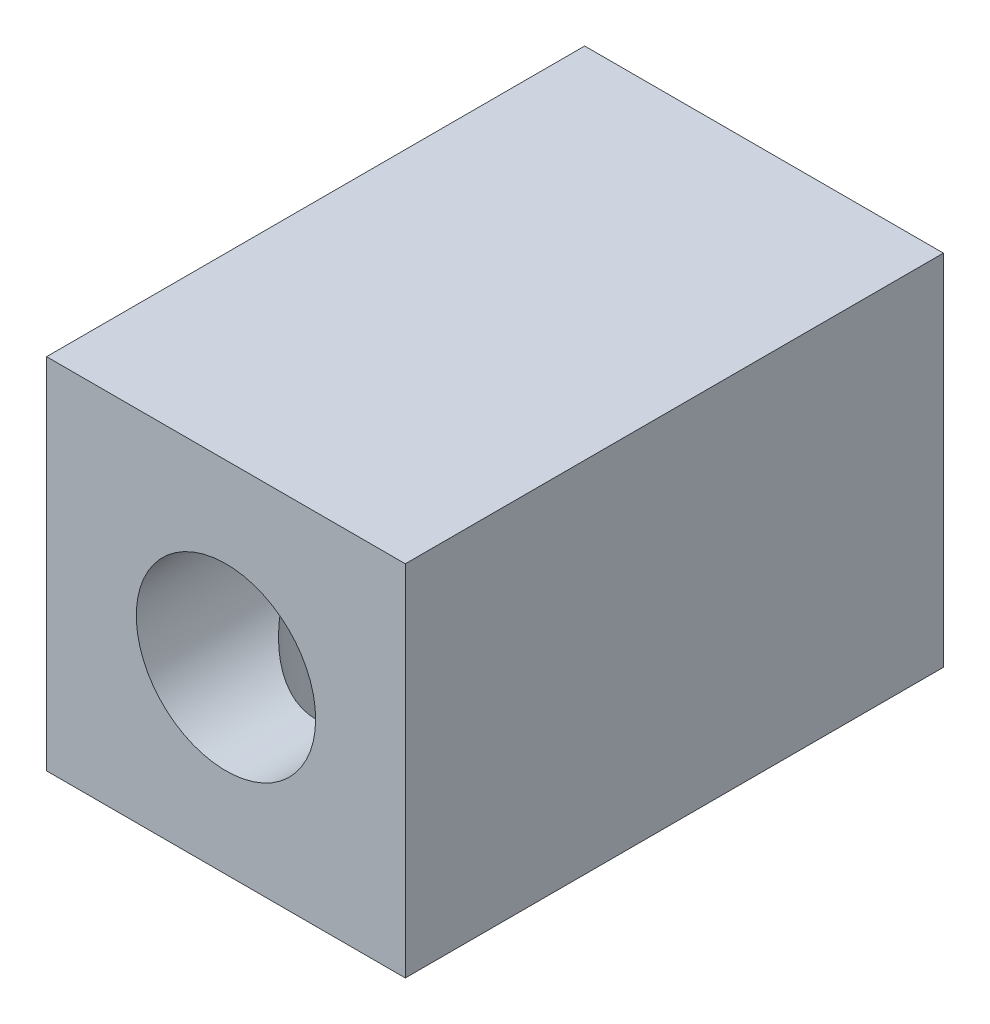
ISO-10303-21;
HEADER;
FILE_DESCRIPTION(('STEP AP214'),'2;1');
FILE_NAME('part.step','',(''),(''),'','','');
FILE_SCHEMA(('AUTOMOTIVE_DESIGN { 1 0 10303 214 1 1 1 1 }'));
ENDSEC;
DATA;
#1=APPLICATION_CONTEXT('core data for automotive mechanical design processes');
#2=APPLICATION_PROTOCOL_DEFINITION('international standard','automotive_design',2000,#1);
#3=PRODUCT_CONTEXT('',#1,'mechanical');
#4=PRODUCT('Part','Part','',(#3));
#5=PRODUCT_RELATED_PRODUCT_CATEGORY('part','',(#4));
#6=PRODUCT_DEFINITION_FORMATION('','',#4);
#7=PRODUCT_DEFINITION_CONTEXT('part definition',#1,'design');
#8=PRODUCT_DEFINITION('design','',#6,#7);
#9=PRODUCT_DEFINITION_SHAPE('','',#8);
#10=(LENGTH_UNIT() NAMED_UNIT(*) SI_UNIT(.MILLI.,.METRE.));
#11=(NAMED_UNIT(*) PLANE_ANGLE_UNIT() SI_UNIT($,.RADIAN.));
#12=(NAMED_UNIT(*) SI_UNIT($,.STERADIAN.) SOLID_ANGLE_UNIT());
#13=UNCERTAINTY_MEASURE_WITH_UNIT(LENGTH_MEASURE(1.E-05),#10,'distance_accuracy_value','');
#14=(GEOMETRIC_REPRESENTATION_CONTEXT(3) GLOBAL_UNCERTAINTY_ASSIGNED_CONTEXT((#13)) GLOBAL_UNIT_ASSIGNED_CONTEXT((#10,
#11,#12)) REPRESENTATION_CONTEXT('',''));
#15=CARTESIAN_POINT('',(0.,0.,0.));
#16=DIRECTION('',(0.,0.,1.));
#17=DIRECTION('',(1.,0.,0.));
#18=AXIS2_PLACEMENT_3D('',#15,#16,#17);
#19=CARTESIAN_POINT('',(-4.99999999999981,-5.00000000000178,14.9999999999994));
#20=DIRECTION('',(0.,0.,-1.00000000000002));
#21=DIRECTION('',(-0.999999999999995,0.,0.));
#22=AXIS2_PLACEMENT_3D('',#19,#20,#21);
#23=PLANE('',#22);
#24=DIRECTION('',(0.,-1.,0.));
#25=VECTOR('',#24,1.);
#26=CARTESIAN_POINT('',(-4.99999999999981,-5.00000000000178,14.9999999999994));
#27=LINE('',#26,#25);
#28=CARTESIAN_POINT('',(-4.99999999999967,4.99999999999806,14.9999999999998));
#29=VERTEX_POINT('',#28);
#30=CARTESIAN_POINT('',(-4.99999999999981,-5.00000000000178,14.9999999999994));
#31=VERTEX_POINT('',#30);
#32=EDGE_CURVE('E91',#29,#31,#27,.T.);
#33=ORIENTED_EDGE('',*,*,#32,.T.);
#34=DIRECTION('',(0.999999999999995,0.,0.));
#35=VECTOR('',#34,1.);
#36=CARTESIAN_POINT('',(-4.99999999999981,-5.00000000000178,14.9999999999994));
#37=LINE('',#36,#35);
#38=CARTESIAN_POINT('',(5.00000000000073,-5.00000000000167,14.9999999999991));
#39=VERTEX_POINT('',#38);
#40=EDGE_CURVE('E93',#31,#39,#37,.T.);
#41=ORIENTED_EDGE('',*,*,#40,.T.);
#42=DIRECTION('',(0.,1.,0.));
#43=VECTOR('',#42,1.);
#44=CARTESIAN_POINT('',(5.00000000000073,-5.00000000000167,14.9999999999991));
#45=LINE('',#44,#43);
#46=CARTESIAN_POINT('',(5.00000000000031,4.99999999999812,14.9999999999996));
#47=VERTEX_POINT('',#46);
#48=EDGE_CURVE('E95',#39,#47,#45,.T.);
#49=ORIENTED_EDGE('',*,*,#48,.T.);
#50=DIRECTION('',(-0.999999999999995,0.,0.));
#51=VECTOR('',#50,1.);
#52=CARTESIAN_POINT('',(-4.99999999999967,4.99999999999806,14.9999999999998));
#53=LINE('',#52,#51);
#54=EDGE_CURVE('E36',#47,#29,#53,.T.);
#55=ORIENTED_EDGE('',*,*,#54,.T.);
#56=EDGE_LOOP('',(#33,#41,#49,#55));
#57=FACE_BOUND('',#56,.T.);
#58=CARTESIAN_POINT('',(3.60822483003176E-13,-1.66533453693773E-12,14.9999999999994));
#59=DIRECTION('',(0.,0.,1.00000000000002));
#60=DIRECTION('',(0.999999999999995,0.,0.));
#61=AXIS2_PLACEMENT_3D('',#58,#59,#60);
#62=CIRCLE('',#61,2.5);
#63=CARTESIAN_POINT('',(2.50000000000035,-1.69167143401067E-12,14.9999999999995));
#64=VERTEX_POINT('',#63);
#65=EDGE_CURVE('E71',#64,#64,#62,.T.);
#66=ORIENTED_EDGE('',*,*,#65,.F.);
#67=EDGE_LOOP('',(#66));
#68=FACE_BOUND('',#67,.T.);
#69=ADVANCED_FACE('F16',(#57,#68),#23,.F.);
#70=CARTESIAN_POINT('',(-4.99999999999998,-5.00000000000161,0.));
#71=DIRECTION('',(0.,0.,-1.00000000000002));
#72=DIRECTION('',(-0.999999999999995,0.,0.));
#73=AXIS2_PLACEMENT_3D('',#70,#71,#72);
#74=PLANE('',#73);
#75=DIRECTION('',(0.,-1.,0.));
#76=VECTOR('',#75,1.);
#77=CARTESIAN_POINT('',(-4.99999999999998,-5.00000000000161,0.));
#78=LINE('',#77,#76);
#79=CARTESIAN_POINT('',(-4.99999999999992,4.99999999999906,-2.24820162486594E-12));
#80=VERTEX_POINT('',#79);
#81=CARTESIAN_POINT('',(-4.99999999999998,-5.00000000000161,0.));
#82=VERTEX_POINT('',#81);
#83=EDGE_CURVE('E78',#80,#82,#78,.T.);
#84=ORIENTED_EDGE('',*,*,#83,.F.);
#85=DIRECTION('',(-0.999999999999995,0.,0.));
#86=VECTOR('',#85,1.);
#87=CARTESIAN_POINT('',(-4.99999999999992,4.99999999999906,-2.24820162486594E-12));
#88=LINE('',#87,#86);
#89=CARTESIAN_POINT('',(5.00000000000017,5.00000000000056,-1.38777878078145E-12));
#90=VERTEX_POINT('',#89);
#91=EDGE_CURVE('E89',#90,#80,#88,.T.);
#92=ORIENTED_EDGE('',*,*,#91,.F.);
#93=DIRECTION('',(0.,1.,0.));
#94=VECTOR('',#93,1.);
#95=CARTESIAN_POINT('',(4.99999999999987,-5.00000000000089,-4.57966997657877E-13));
#96=LINE('',#95,#94);
#97=CARTESIAN_POINT('',(4.99999999999987,-5.00000000000089,-4.57966997657877E-13));
#98=VERTEX_POINT('',#97);
#99=EDGE_CURVE('E87',#98,#90,#96,.T.);
#100=ORIENTED_EDGE('',*,*,#99,.F.);
#101=DIRECTION('',(0.999999999999995,0.,0.));
#102=VECTOR('',#101,1.);
#103=CARTESIAN_POINT('',(-4.99999999999998,-5.00000000000161,0.));
#104=LINE('',#103,#102);
#105=EDGE_CURVE('E85',#82,#98,#104,.T.);
#106=ORIENTED_EDGE('',*,*,#105,.F.);
#107=EDGE_LOOP('',(#84,#92,#100,#106));
#108=FACE_BOUND('',#107,.T.);
#109=CARTESIAN_POINT('',(-1.11022302462516E-13,2.77555756156289E-13,0.));
#110=DIRECTION('',(0.,0.,1.00000000000002));
#111=DIRECTION('',(0.999999999999995,0.,0.));
#112=AXIS2_PLACEMENT_3D('',#109,#110,#111);
#113=CIRCLE('',#112,2.5);
#114=CARTESIAN_POINT('',(2.49999999999988,2.51218859083358E-13,1.19129966308362E-13));
#115=VERTEX_POINT('',#114);
#116=EDGE_CURVE('E74',#115,#115,#113,.T.);
#117=ORIENTED_EDGE('',*,*,#116,.T.);
#118=EDGE_LOOP('',(#117));
#119=FACE_BOUND('',#118,.T.);
#120=ADVANCED_FACE('F117',(#108,#119),#74,.T.);
#121=CARTESIAN_POINT('',(-4.99999999999981,-5.00000000000178,14.9999999999994));
#122=DIRECTION('',(0.999999999999995,0.,0.));
#123=DIRECTION('',(0.,0.,-1.00000000000002));
#124=AXIS2_PLACEMENT_3D('',#121,#122,#123);
#125=PLANE('',#124);
#126=ORIENTED_EDGE('',*,*,#83,.T.);
#127=DIRECTION('',(0.,0.,-1.00000000000002));
#128=VECTOR('',#127,1.);
#129=CARTESIAN_POINT('',(-4.99999999999981,-5.00000000000178,14.9999999999994));
#130=LINE('',#129,#128);
#131=EDGE_CURVE('E62',#31,#82,#130,.T.);
#132=ORIENTED_EDGE('',*,*,#131,.F.);
#133=ORIENTED_EDGE('',*,*,#32,.F.);
#134=DIRECTION('',(0.,0.,-1.00000000000002));
#135=VECTOR('',#134,1.);
#136=CARTESIAN_POINT('',(-4.99999999999967,4.99999999999806,14.9999999999998));
#137=LINE('',#136,#135);
#138=EDGE_CURVE('E98',#29,#80,#137,.T.);
#139=ORIENTED_EDGE('',*,*,#138,.T.);
#140=EDGE_LOOP('',(#126,#132,#133,#139));
#141=FACE_BOUND('',#140,.T.);
#142=ADVANCED_FACE('F18',(#141),#125,.F.);
#143=CARTESIAN_POINT('',(-4.99999999999981,-5.00000000000178,14.9999999999994));
#144=DIRECTION('',(0.,1.,0.));
#145=DIRECTION('',(0.,0.,1.00000000000002));
#146=AXIS2_PLACEMENT_3D('',#143,#144,#145);
#147=PLANE('',#146);
#148=CARTESIAN_POINT('',(3.05311331771918E-13,-5.00000000000167,9.99999999999943));
#149=DIRECTION('',(0.,1.,0.));
#150=DIRECTION('',(0.,0.,1.00000000000002));
#151=AXIS2_PLACEMENT_3D('',#148,#149,#150);
#152=CIRCLE('',#151,2.5);
#153=CARTESIAN_POINT('',(3.27873578981341E-13,-5.00000000000169,12.4999999999995));
#154=VERTEX_POINT('',#153);
#155=EDGE_CURVE('E76',#154,#154,#152,.T.);
#156=ORIENTED_EDGE('',*,*,#155,.T.);
#157=EDGE_LOOP('',(#156));
#158=FACE_BOUND('',#157,.T.);
#159=ORIENTED_EDGE('',*,*,#105,.T.);
#160=DIRECTION('',(0.,0.,-1.00000000000002));
#161=VECTOR('',#160,1.);
#162=CARTESIAN_POINT('',(5.00000000000073,-5.00000000000167,14.9999999999991));
#163=LINE('',#162,#161);
#164=EDGE_CURVE('E104',#39,#98,#163,.T.);
#165=ORIENTED_EDGE('',*,*,#164,.F.);
#166=ORIENTED_EDGE('',*,*,#40,.F.);
#167=ORIENTED_EDGE('',*,*,#131,.T.);
#168=EDGE_LOOP('',(#159,#165,#166,#167));
#169=FACE_BOUND('',#168,.T.);
#170=ADVANCED_FACE('F110',(#158,#169),#147,.F.);
#171=CARTESIAN_POINT('',(5.00000000000073,-5.00000000000167,14.9999999999991));
#172=DIRECTION('',(-0.999999999999995,0.,0.));
#173=DIRECTION('',(0.,0.,1.00000000000002));
#174=AXIS2_PLACEMENT_3D('',#171,#172,#173);
#175=PLANE('',#174);
#176=ORIENTED_EDGE('',*,*,#99,.T.);
#177=DIRECTION('',(0.,0.,-1.00000000000002));
#178=VECTOR('',#177,1.);
#179=CARTESIAN_POINT('',(5.00000000000031,4.99999999999812,14.9999999999996));
#180=LINE('',#179,#178);
#181=EDGE_CURVE('E101',#47,#90,#180,.T.);
#182=ORIENTED_EDGE('',*,*,#181,.F.);
#183=ORIENTED_EDGE('',*,*,#48,.F.);
#184=ORIENTED_EDGE('',*,*,#164,.T.);
#185=EDGE_LOOP('',(#176,#182,#183,#184));
#186=FACE_BOUND('',#185,.T.);
#187=ADVANCED_FACE('F121',(#186),#175,.F.);
#188=CARTESIAN_POINT('',(-4.99999999999967,4.99999999999806,14.9999999999998));
#189=DIRECTION('',(0.,-1.,0.));
#190=DIRECTION('',(0.999999999999995,0.,0.));
#191=AXIS2_PLACEMENT_3D('',#188,#189,#190);
#192=PLANE('',#191);
#193=ORIENTED_EDGE('',*,*,#91,.T.);
#194=ORIENTED_EDGE('',*,*,#138,.F.);
#195=ORIENTED_EDGE('',*,*,#54,.F.);
#196=ORIENTED_EDGE('',*,*,#181,.T.);
#197=EDGE_LOOP('',(#193,#194,#195,#196));
#198=FACE_BOUND('',#197,.T.);
#199=ADVANCED_FACE('F66',(#198),#192,.F.);
#200=CARTESIAN_POINT('',(3.60822483003176E-13,-1.66533453693773E-12,14.9999999999994));
#201=DIRECTION('',(0.,0.,-1.00000000000002));
#202=DIRECTION('',(-0.999999999999995,0.,0.));
#203=AXIS2_PLACEMENT_3D('',#200,#201,#202);
#204=CYLINDRICAL_SURFACE('',#203,2.5);
#205=CARTESIAN_POINT('',(2.77555756156289E-13,-1.33226762955019E-12,9.99999999999958));
#206=DIRECTION('',(0.,0.707106781186557,-0.707106781186568));
#207=DIRECTION('',(0.,-0.707106781186556,-0.70710678118656));
#208=AXIS2_PLACEMENT_3D('',#205,#206,#207);
#209=ELLIPSE('',#208,3.53553390593274,2.5);
#210=CARTESIAN_POINT('',(2.50000000000003,-2.33146835171283E-12,10.0000000000003));
#211=VERTEX_POINT('',#210);
#212=CARTESIAN_POINT('',(-2.49999999999981,-2.1094237467878E-12,9.99999999999925));
#213=VERTEX_POINT('',#212);
#214=EDGE_CURVE('E11',#211,#213,#209,.T.);
#215=ORIENTED_EDGE('',*,*,#214,.F.);
#216=CARTESIAN_POINT('',(2.77555756156289E-13,-1.33226762955019E-12,9.99999999999958));
#217=DIRECTION('',(0.,-0.707106781186556,-0.70710678118656));
#218=DIRECTION('',(0.,0.707106781186557,-0.707106781186568));
#219=AXIS2_PLACEMENT_3D('',#216,#217,#218);
#220=ELLIPSE('',#219,3.53553390593274,2.5);
#221=EDGE_CURVE('E24',#213,#211,#220,.F.);
#222=ORIENTED_EDGE('',*,*,#221,.F.);
#223=EDGE_LOOP('',(#215,#222));
#224=FACE_BOUND('',#223,.T.);
#225=ORIENTED_EDGE('',*,*,#65,.T.);
#226=EDGE_LOOP('',(#225));
#227=FACE_BOUND('',#226,.T.);
#228=ORIENTED_EDGE('',*,*,#116,.F.);
#229=EDGE_LOOP('',(#228));
#230=FACE_BOUND('',#229,.T.);
#231=ADVANCED_FACE('F63',(#224,#227,#230),#204,.F.);
#232=CARTESIAN_POINT('',(3.05311331771918E-13,-5.00000000000167,9.99999999999943));
#233=DIRECTION('',(0.,1.,0.));
#234=DIRECTION('',(0.,0.,1.00000000000002));
#235=AXIS2_PLACEMENT_3D('',#232,#233,#234);
#236=CYLINDRICAL_SURFACE('',#235,2.5);
#237=ORIENTED_EDGE('',*,*,#214,.T.);
#238=ORIENTED_EDGE('',*,*,#221,.T.);
#239=EDGE_LOOP('',(#237,#238));
#240=FACE_BOUND('',#239,.T.);
#241=ORIENTED_EDGE('',*,*,#155,.F.);
#242=EDGE_LOOP('',(#241));
#243=FACE_BOUND('',#242,.T.);
#244=ADVANCED_FACE('F59',(#240,#243),#236,.F.);
#245=CLOSED_SHELL('',(#69,#120,#142,#170,#187,#199,#231,#244));
#246=MANIFOLD_SOLID_BREP('B1',#245);
#247=ADVANCED_BREP_SHAPE_REPRESENTATION('',(#18,#246),#14);
#248=SHAPE_DEFINITION_REPRESENTATION(#9,#247);
ENDSEC;
END-ISO-10303-21;
